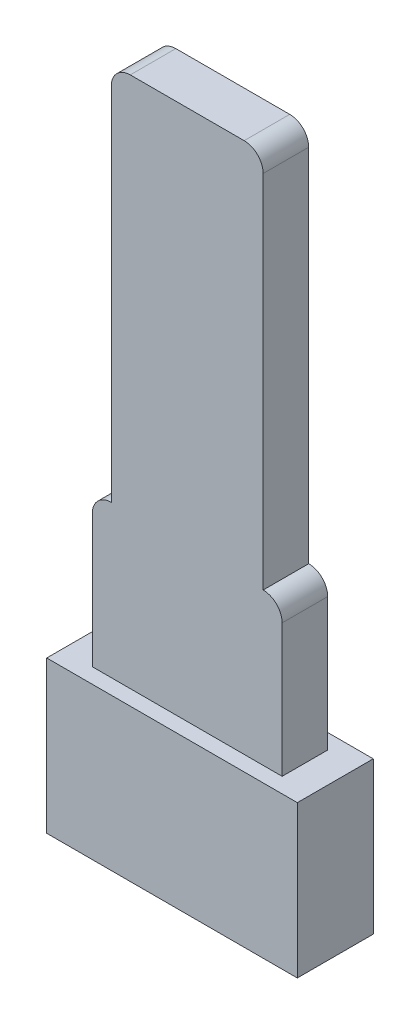
ISO-10303-21;
HEADER;
FILE_DESCRIPTION(('STEP AP214'),'2;1');
FILE_NAME('part.step','',(''),(''),'','','');
FILE_SCHEMA(('AUTOMOTIVE_DESIGN { 1 0 10303 214 1 1 1 1 }'));
ENDSEC;
DATA;
#1=APPLICATION_CONTEXT('core data for automotive mechanical design processes');
#2=APPLICATION_PROTOCOL_DEFINITION('international standard','automotive_design',2000,#1);
#3=PRODUCT_CONTEXT('',#1,'mechanical');
#4=PRODUCT('Part','Part','',(#3));
#5=PRODUCT_RELATED_PRODUCT_CATEGORY('part','',(#4));
#6=PRODUCT_DEFINITION_FORMATION('','',#4);
#7=PRODUCT_DEFINITION_CONTEXT('part definition',#1,'design');
#8=PRODUCT_DEFINITION('design','',#6,#7);
#9=PRODUCT_DEFINITION_SHAPE('','',#8);
#10=(LENGTH_UNIT() NAMED_UNIT(*) SI_UNIT(.MILLI.,.METRE.));
#11=(NAMED_UNIT(*) PLANE_ANGLE_UNIT() SI_UNIT($,.RADIAN.));
#12=(NAMED_UNIT(*) SI_UNIT($,.STERADIAN.) SOLID_ANGLE_UNIT());
#13=UNCERTAINTY_MEASURE_WITH_UNIT(LENGTH_MEASURE(1.E-05),#10,'distance_accuracy_value','');
#14=(GEOMETRIC_REPRESENTATION_CONTEXT(3) GLOBAL_UNCERTAINTY_ASSIGNED_CONTEXT((#13)) GLOBAL_UNIT_ASSIGNED_CONTEXT((#10,
#11,#12)) REPRESENTATION_CONTEXT('',''));
#15=CARTESIAN_POINT('',(0.,0.,0.));
#16=DIRECTION('',(0.,0.,1.));
#17=DIRECTION('',(1.,0.,0.));
#18=AXIS2_PLACEMENT_3D('',#15,#16,#17);
#19=CARTESIAN_POINT('',(0.,4.,0.));
#20=DIRECTION('',(0.,-1.,0.));
#21=DIRECTION('',(0.,0.,-1.));
#22=AXIS2_PLACEMENT_3D('',#19,#20,#21);
#23=PLANE('',#22);
#24=DIRECTION('',(0.,0.,-1.));
#25=VECTOR('',#24,1.);
#26=CARTESIAN_POINT('',(3.3,4.,1.));
#27=LINE('',#26,#25);
#28=CARTESIAN_POINT('',(3.3,4.,1.));
#29=VERTEX_POINT('',#28);
#30=CARTESIAN_POINT('',(3.3,4.,-1.));
#31=VERTEX_POINT('',#30);
#32=EDGE_CURVE('E193',#29,#31,#27,.T.);
#33=ORIENTED_EDGE('',*,*,#32,.T.);
#34=DIRECTION('',(-1.,0.,0.));
#35=VECTOR('',#34,1.);
#36=CARTESIAN_POINT('',(-3.3,4.,-1.));
#37=LINE('',#36,#35);
#38=CARTESIAN_POINT('',(-3.3,4.,-1.));
#39=VERTEX_POINT('',#38);
#40=EDGE_CURVE('E196',#31,#39,#37,.T.);
#41=ORIENTED_EDGE('',*,*,#40,.T.);
#42=DIRECTION('',(0.,0.,1.));
#43=VECTOR('',#42,1.);
#44=CARTESIAN_POINT('',(-3.3,4.,1.));
#45=LINE('',#44,#43);
#46=CARTESIAN_POINT('',(-3.3,4.,1.));
#47=VERTEX_POINT('',#46);
#48=EDGE_CURVE('E199',#39,#47,#45,.T.);
#49=ORIENTED_EDGE('',*,*,#48,.T.);
#50=DIRECTION('',(1.,0.,0.));
#51=VECTOR('',#50,1.);
#52=CARTESIAN_POINT('',(-3.3,4.,1.));
#53=LINE('',#52,#51);
#54=EDGE_CURVE('E201',#47,#29,#53,.T.);
#55=ORIENTED_EDGE('',*,*,#54,.T.);
#56=EDGE_LOOP('',(#33,#41,#49,#55));
#57=FACE_BOUND('',#56,.T.);
#58=DIRECTION('',(0.,0.,-1.));
#59=VECTOR('',#58,1.);
#60=CARTESIAN_POINT('',(2.5,4.,0.6));
#61=LINE('',#60,#59);
#62=CARTESIAN_POINT('',(2.5,4.,0.6));
#63=VERTEX_POINT('',#62);
#64=CARTESIAN_POINT('',(2.5,4.,-0.6));
#65=VERTEX_POINT('',#64);
#66=EDGE_CURVE('E171',#63,#65,#61,.T.);
#67=ORIENTED_EDGE('',*,*,#66,.F.);
#68=DIRECTION('',(1.,0.,0.));
#69=VECTOR('',#68,1.);
#70=CARTESIAN_POINT('',(-2.5,4.,0.6));
#71=LINE('',#70,#69);
#72=CARTESIAN_POINT('',(-2.5,4.,0.6));
#73=VERTEX_POINT('',#72);
#74=EDGE_CURVE('E181',#73,#63,#71,.T.);
#75=ORIENTED_EDGE('',*,*,#74,.F.);
#76=DIRECTION('',(0.,0.,1.));
#77=VECTOR('',#76,1.);
#78=CARTESIAN_POINT('',(-2.5,4.,0.6));
#79=LINE('',#78,#77);
#80=CARTESIAN_POINT('',(-2.5,4.,-0.6));
#81=VERTEX_POINT('',#80);
#82=EDGE_CURVE('E178',#81,#73,#79,.T.);
#83=ORIENTED_EDGE('',*,*,#82,.F.);
#84=DIRECTION('',(-1.,0.,0.));
#85=VECTOR('',#84,1.);
#86=CARTESIAN_POINT('',(-2.5,4.,-0.6));
#87=LINE('',#86,#85);
#88=EDGE_CURVE('E174',#65,#81,#87,.T.);
#89=ORIENTED_EDGE('',*,*,#88,.F.);
#90=EDGE_LOOP('',(#67,#75,#83,#89));
#91=FACE_BOUND('',#90,.T.);
#92=ADVANCED_FACE('F33',(#57,#91),#23,.F.);
#93=CARTESIAN_POINT('',(3.3,4.,1.));
#94=DIRECTION('',(-1.,0.,0.));
#95=DIRECTION('',(0.,0.,1.));
#96=AXIS2_PLACEMENT_3D('',#93,#94,#95);
#97=PLANE('',#96);
#98=DIRECTION('',(0.,0.,-1.));
#99=VECTOR('',#98,1.);
#100=CARTESIAN_POINT('',(3.3,0.,1.));
#101=LINE('',#100,#99);
#102=CARTESIAN_POINT('',(3.3,0.,1.));
#103=VERTEX_POINT('',#102);
#104=CARTESIAN_POINT('',(3.3,0.,-1.));
#105=VERTEX_POINT('',#104);
#106=EDGE_CURVE('E192',#103,#105,#101,.T.);
#107=ORIENTED_EDGE('',*,*,#106,.T.);
#108=DIRECTION('',(0.,-1.,0.));
#109=VECTOR('',#108,1.);
#110=CARTESIAN_POINT('',(3.3,4.,-1.));
#111=LINE('',#110,#109);
#112=EDGE_CURVE('E162',#31,#105,#111,.T.);
#113=ORIENTED_EDGE('',*,*,#112,.F.);
#114=ORIENTED_EDGE('',*,*,#32,.F.);
#115=DIRECTION('',(0.,-1.,0.));
#116=VECTOR('',#115,1.);
#117=CARTESIAN_POINT('',(3.3,4.,1.));
#118=LINE('',#117,#116);
#119=EDGE_CURVE('E203',#29,#103,#118,.T.);
#120=ORIENTED_EDGE('',*,*,#119,.T.);
#121=EDGE_LOOP('',(#107,#113,#114,#120));
#122=FACE_BOUND('',#121,.T.);
#123=ADVANCED_FACE('F305',(#122),#97,.F.);
#124=CARTESIAN_POINT('',(-3.3,4.,-1.));
#125=DIRECTION('',(0.,0.,1.));
#126=DIRECTION('',(1.,0.,0.));
#127=AXIS2_PLACEMENT_3D('',#124,#125,#126);
#128=PLANE('',#127);
#129=DIRECTION('',(-1.,0.,0.));
#130=VECTOR('',#129,1.);
#131=CARTESIAN_POINT('',(-3.3,0.,-1.));
#132=LINE('',#131,#130);
#133=CARTESIAN_POINT('',(-3.3,0.,-1.));
#134=VERTEX_POINT('',#133);
#135=EDGE_CURVE('E206',#105,#134,#132,.T.);
#136=ORIENTED_EDGE('',*,*,#135,.T.);
#137=DIRECTION('',(0.,-1.,0.));
#138=VECTOR('',#137,1.);
#139=CARTESIAN_POINT('',(-3.3,4.,-1.));
#140=LINE('',#139,#138);
#141=EDGE_CURVE('E215',#39,#134,#140,.T.);
#142=ORIENTED_EDGE('',*,*,#141,.F.);
#143=ORIENTED_EDGE('',*,*,#40,.F.);
#144=ORIENTED_EDGE('',*,*,#112,.T.);
#145=EDGE_LOOP('',(#136,#142,#143,#144));
#146=FACE_BOUND('',#145,.T.);
#147=ADVANCED_FACE('F311',(#146),#128,.F.);
#148=CARTESIAN_POINT('',(-3.3,4.,1.));
#149=DIRECTION('',(1.,0.,0.));
#150=DIRECTION('',(0.,0.,-1.));
#151=AXIS2_PLACEMENT_3D('',#148,#149,#150);
#152=PLANE('',#151);
#153=DIRECTION('',(0.,0.,1.));
#154=VECTOR('',#153,1.);
#155=CARTESIAN_POINT('',(-3.3,0.,1.));
#156=LINE('',#155,#154);
#157=CARTESIAN_POINT('',(-3.3,0.,1.));
#158=VERTEX_POINT('',#157);
#159=EDGE_CURVE('E208',#134,#158,#156,.T.);
#160=ORIENTED_EDGE('',*,*,#159,.T.);
#161=DIRECTION('',(0.,-1.,0.));
#162=VECTOR('',#161,1.);
#163=CARTESIAN_POINT('',(-3.3,4.,1.));
#164=LINE('',#163,#162);
#165=EDGE_CURVE('E213',#47,#158,#164,.T.);
#166=ORIENTED_EDGE('',*,*,#165,.F.);
#167=ORIENTED_EDGE('',*,*,#48,.F.);
#168=ORIENTED_EDGE('',*,*,#141,.T.);
#169=EDGE_LOOP('',(#160,#166,#167,#168));
#170=FACE_BOUND('',#169,.T.);
#171=ADVANCED_FACE('F324',(#170),#152,.F.);
#172=CARTESIAN_POINT('',(-3.3,4.,1.));
#173=DIRECTION('',(0.,0.,-1.));
#174=DIRECTION('',(-1.,0.,0.));
#175=AXIS2_PLACEMENT_3D('',#172,#173,#174);
#176=PLANE('',#175);
#177=DIRECTION('',(1.,0.,0.));
#178=VECTOR('',#177,1.);
#179=CARTESIAN_POINT('',(-3.3,0.,1.));
#180=LINE('',#179,#178);
#181=EDGE_CURVE('E197',#158,#103,#180,.T.);
#182=ORIENTED_EDGE('',*,*,#181,.T.);
#183=ORIENTED_EDGE('',*,*,#119,.F.);
#184=ORIENTED_EDGE('',*,*,#54,.F.);
#185=ORIENTED_EDGE('',*,*,#165,.T.);
#186=EDGE_LOOP('',(#182,#183,#184,#185));
#187=FACE_BOUND('',#186,.T.);
#188=ADVANCED_FACE('F320',(#187),#176,.F.);
#189=CARTESIAN_POINT('',(0.,0.,0.));
#190=DIRECTION('',(0.,-1.,0.));
#191=DIRECTION('',(0.,0.,-1.));
#192=AXIS2_PLACEMENT_3D('',#189,#190,#191);
#193=PLANE('',#192);
#194=ORIENTED_EDGE('',*,*,#106,.F.);
#195=ORIENTED_EDGE('',*,*,#181,.F.);
#196=ORIENTED_EDGE('',*,*,#159,.F.);
#197=ORIENTED_EDGE('',*,*,#135,.F.);
#198=EDGE_LOOP('',(#194,#195,#196,#197));
#199=FACE_BOUND('',#198,.T.);
#200=ADVANCED_FACE('F317',(#199),#193,.T.);
#201=CARTESIAN_POINT('',(2.5,8.,0.6));
#202=DIRECTION('',(-1.,0.,0.));
#203=DIRECTION('',(0.,0.,1.));
#204=AXIS2_PLACEMENT_3D('',#201,#202,#203);
#205=PLANE('',#204);
#206=DIRECTION('',(0.,-1.,0.));
#207=VECTOR('',#206,1.);
#208=CARTESIAN_POINT('',(2.5,8.,-0.6));
#209=LINE('',#208,#207);
#210=CARTESIAN_POINT('',(2.5,7.5,-0.6));
#211=VERTEX_POINT('',#210);
#212=EDGE_CURVE('E190',#211,#65,#209,.T.);
#213=ORIENTED_EDGE('',*,*,#212,.F.);
#214=DIRECTION('',(0.,0.,-1.));
#215=VECTOR('',#214,1.);
#216=CARTESIAN_POINT('',(2.5,7.5,0.6));
#217=LINE('',#216,#215);
#218=CARTESIAN_POINT('',(2.5,7.5,0.6));
#219=VERTEX_POINT('',#218);
#220=EDGE_CURVE('E241',#211,#219,#217,.F.);
#221=ORIENTED_EDGE('',*,*,#220,.T.);
#222=DIRECTION('',(0.,-1.,0.));
#223=VECTOR('',#222,1.);
#224=CARTESIAN_POINT('',(2.5,8.,0.6));
#225=LINE('',#224,#223);
#226=EDGE_CURVE('E184',#219,#63,#225,.T.);
#227=ORIENTED_EDGE('',*,*,#226,.T.);
#228=ORIENTED_EDGE('',*,*,#66,.T.);
#229=EDGE_LOOP('',(#213,#221,#227,#228));
#230=FACE_BOUND('',#229,.T.);
#231=ADVANCED_FACE('F265',(#230),#205,.F.);
#232=CARTESIAN_POINT('',(-2.5,8.,-0.6));
#233=DIRECTION('',(0.,0.,1.));
#234=DIRECTION('',(1.,0.,0.));
#235=AXIS2_PLACEMENT_3D('',#232,#233,#234);
#236=PLANE('',#235);
#237=DIRECTION('',(0.,-1.,0.));
#238=VECTOR('',#237,1.);
#239=CARTESIAN_POINT('',(2.,18.,-0.6));
#240=LINE('',#239,#238);
#241=CARTESIAN_POINT('',(2.,17.5,-0.6));
#242=VERTEX_POINT('',#241);
#243=CARTESIAN_POINT('',(2.,8.,-0.6));
#244=VERTEX_POINT('',#243);
#245=EDGE_CURVE('E175',#242,#244,#240,.T.);
#246=ORIENTED_EDGE('',*,*,#245,.T.);
#247=CARTESIAN_POINT('',(2.,7.5,-0.6));
#248=DIRECTION('',(0.,0.,1.));
#249=DIRECTION('',(1.,0.,0.));
#250=AXIS2_PLACEMENT_3D('',#247,#248,#249);
#251=CIRCLE('',#250,0.5);
#252=EDGE_CURVE('E237',#244,#211,#251,.F.);
#253=ORIENTED_EDGE('',*,*,#252,.T.);
#254=ORIENTED_EDGE('',*,*,#212,.T.);
#255=ORIENTED_EDGE('',*,*,#88,.T.);
#256=DIRECTION('',(0.,-1.,0.));
#257=VECTOR('',#256,1.);
#258=CARTESIAN_POINT('',(-2.5,8.,-0.6));
#259=LINE('',#258,#257);
#260=CARTESIAN_POINT('',(-2.5,7.5,-0.6));
#261=VERTEX_POINT('',#260);
#262=EDGE_CURVE('E188',#261,#81,#259,.T.);
#263=ORIENTED_EDGE('',*,*,#262,.F.);
#264=CARTESIAN_POINT('',(-2.,7.5,-0.6));
#265=DIRECTION('',(0.,0.,1.));
#266=DIRECTION('',(1.,0.,0.));
#267=AXIS2_PLACEMENT_3D('',#264,#265,#266);
#268=CIRCLE('',#267,0.5);
#269=CARTESIAN_POINT('',(-2.,8.,-0.6));
#270=VERTEX_POINT('',#269);
#271=EDGE_CURVE('E230',#261,#270,#268,.F.);
#272=ORIENTED_EDGE('',*,*,#271,.T.);
#273=DIRECTION('',(0.,-1.,0.));
#274=VECTOR('',#273,1.);
#275=CARTESIAN_POINT('',(-2.,18.,-0.6));
#276=LINE('',#275,#274);
#277=CARTESIAN_POINT('',(-2.,17.5,-0.6));
#278=VERTEX_POINT('',#277);
#279=EDGE_CURVE('E145',#278,#270,#276,.T.);
#280=ORIENTED_EDGE('',*,*,#279,.F.);
#281=CARTESIAN_POINT('',(-1.5,17.5,-0.6));
#282=DIRECTION('',(0.,0.,1.));
#283=DIRECTION('',(1.,0.,0.));
#284=AXIS2_PLACEMENT_3D('',#281,#282,#283);
#285=CIRCLE('',#284,0.5);
#286=CARTESIAN_POINT('',(-1.5,18.,-0.6));
#287=VERTEX_POINT('',#286);
#288=EDGE_CURVE('E222',#278,#287,#285,.F.);
#289=ORIENTED_EDGE('',*,*,#288,.T.);
#290=DIRECTION('',(-1.,0.,0.));
#291=VECTOR('',#290,1.);
#292=CARTESIAN_POINT('',(-2.,18.,-0.6));
#293=LINE('',#292,#291);
#294=CARTESIAN_POINT('',(1.5,18.,-0.6));
#295=VERTEX_POINT('',#294);
#296=EDGE_CURVE('E151',#295,#287,#293,.T.);
#297=ORIENTED_EDGE('',*,*,#296,.F.);
#298=CARTESIAN_POINT('',(1.5,17.5,-0.6));
#299=DIRECTION('',(0.,0.,1.));
#300=DIRECTION('',(1.,0.,0.));
#301=AXIS2_PLACEMENT_3D('',#298,#299,#300);
#302=CIRCLE('',#301,0.5);
#303=EDGE_CURVE('E225',#295,#242,#302,.F.);
#304=ORIENTED_EDGE('',*,*,#303,.T.);
#305=EDGE_LOOP('',(#246,#253,#254,#255,#263,#272,#280,#289,#297,#304));
#306=FACE_BOUND('',#305,.T.);
#307=ADVANCED_FACE('F253',(#306),#236,.F.);
#308=CARTESIAN_POINT('',(-2.5,8.,0.6));
#309=DIRECTION('',(1.,0.,0.));
#310=DIRECTION('',(0.,0.,-1.));
#311=AXIS2_PLACEMENT_3D('',#308,#309,#310);
#312=PLANE('',#311);
#313=DIRECTION('',(0.,-1.,0.));
#314=VECTOR('',#313,1.);
#315=CARTESIAN_POINT('',(-2.5,8.,0.6));
#316=LINE('',#315,#314);
#317=CARTESIAN_POINT('',(-2.5,7.5,0.6));
#318=VERTEX_POINT('',#317);
#319=EDGE_CURVE('E186',#318,#73,#316,.T.);
#320=ORIENTED_EDGE('',*,*,#319,.F.);
#321=DIRECTION('',(0.,0.,1.));
#322=VECTOR('',#321,1.);
#323=CARTESIAN_POINT('',(-2.5,7.5,0.6));
#324=LINE('',#323,#322);
#325=EDGE_CURVE('E136',#318,#261,#324,.F.);
#326=ORIENTED_EDGE('',*,*,#325,.T.);
#327=ORIENTED_EDGE('',*,*,#262,.T.);
#328=ORIENTED_EDGE('',*,*,#82,.T.);
#329=EDGE_LOOP('',(#320,#326,#327,#328));
#330=FACE_BOUND('',#329,.T.);
#331=ADVANCED_FACE('F272',(#330),#312,.F.);
#332=CARTESIAN_POINT('',(-2.5,8.,0.6));
#333=DIRECTION('',(0.,0.,-1.));
#334=DIRECTION('',(-1.,0.,0.));
#335=AXIS2_PLACEMENT_3D('',#332,#333,#334);
#336=PLANE('',#335);
#337=ORIENTED_EDGE('',*,*,#226,.F.);
#338=CARTESIAN_POINT('',(2.,7.5,0.6));
#339=DIRECTION('',(0.,0.,-1.));
#340=DIRECTION('',(-1.,0.,0.));
#341=AXIS2_PLACEMENT_3D('',#338,#339,#340);
#342=CIRCLE('',#341,0.5);
#343=CARTESIAN_POINT('',(2.,8.,0.6));
#344=VERTEX_POINT('',#343);
#345=EDGE_CURVE('E137',#219,#344,#342,.F.);
#346=ORIENTED_EDGE('',*,*,#345,.T.);
#347=DIRECTION('',(0.,-1.,0.));
#348=VECTOR('',#347,1.);
#349=CARTESIAN_POINT('',(2.,18.,0.6));
#350=LINE('',#349,#348);
#351=CARTESIAN_POINT('',(2.,17.5,0.6));
#352=VERTEX_POINT('',#351);
#353=EDGE_CURVE('E146',#352,#344,#350,.T.);
#354=ORIENTED_EDGE('',*,*,#353,.F.);
#355=CARTESIAN_POINT('',(1.5,17.5,0.6));
#356=DIRECTION('',(0.,0.,-1.));
#357=DIRECTION('',(-1.,0.,0.));
#358=AXIS2_PLACEMENT_3D('',#355,#356,#357);
#359=CIRCLE('',#358,0.5);
#360=CARTESIAN_POINT('',(1.5,18.,0.6));
#361=VERTEX_POINT('',#360);
#362=EDGE_CURVE('E138',#352,#361,#359,.F.);
#363=ORIENTED_EDGE('',*,*,#362,.T.);
#364=DIRECTION('',(1.,0.,0.));
#365=VECTOR('',#364,1.);
#366=CARTESIAN_POINT('',(-2.,18.,0.6));
#367=LINE('',#366,#365);
#368=CARTESIAN_POINT('',(-1.5,18.,0.6));
#369=VERTEX_POINT('',#368);
#370=EDGE_CURVE('E155',#369,#361,#367,.T.);
#371=ORIENTED_EDGE('',*,*,#370,.F.);
#372=CARTESIAN_POINT('',(-1.5,17.5,0.6));
#373=DIRECTION('',(0.,0.,-1.));
#374=DIRECTION('',(-1.,0.,0.));
#375=AXIS2_PLACEMENT_3D('',#372,#373,#374);
#376=CIRCLE('',#375,0.5);
#377=CARTESIAN_POINT('',(-2.,17.5,0.6));
#378=VERTEX_POINT('',#377);
#379=EDGE_CURVE('E54',#369,#378,#376,.F.);
#380=ORIENTED_EDGE('',*,*,#379,.T.);
#381=DIRECTION('',(0.,-1.,0.));
#382=VECTOR('',#381,1.);
#383=CARTESIAN_POINT('',(-2.,18.,0.6));
#384=LINE('',#383,#382);
#385=CARTESIAN_POINT('',(-2.,8.,0.6));
#386=VERTEX_POINT('',#385);
#387=EDGE_CURVE('E140',#378,#386,#384,.T.);
#388=ORIENTED_EDGE('',*,*,#387,.T.);
#389=CARTESIAN_POINT('',(-2.,7.5,0.6));
#390=DIRECTION('',(0.,0.,-1.));
#391=DIRECTION('',(-1.,0.,0.));
#392=AXIS2_PLACEMENT_3D('',#389,#390,#391);
#393=CIRCLE('',#392,0.5);
#394=EDGE_CURVE('E48',#386,#318,#393,.F.);
#395=ORIENTED_EDGE('',*,*,#394,.T.);
#396=ORIENTED_EDGE('',*,*,#319,.T.);
#397=ORIENTED_EDGE('',*,*,#74,.T.);
#398=EDGE_LOOP('',(#337,#346,#354,#363,#371,#380,#388,#395,#396,#397));
#399=FACE_BOUND('',#398,.T.);
#400=ADVANCED_FACE('F142',(#399),#336,.F.);
#401=CARTESIAN_POINT('',(2.,18.,0.6));
#402=DIRECTION('',(-1.,0.,0.));
#403=DIRECTION('',(0.,0.,1.));
#404=AXIS2_PLACEMENT_3D('',#401,#402,#403);
#405=PLANE('',#404);
#406=ORIENTED_EDGE('',*,*,#245,.F.);
#407=DIRECTION('',(0.,0.,-1.));
#408=VECTOR('',#407,1.);
#409=CARTESIAN_POINT('',(2.,17.5,0.6));
#410=LINE('',#409,#408);
#411=EDGE_CURVE('E41',#242,#352,#410,.F.);
#412=ORIENTED_EDGE('',*,*,#411,.T.);
#413=ORIENTED_EDGE('',*,*,#353,.T.);
#414=DIRECTION('',(0.,0.,-1.));
#415=VECTOR('',#414,1.);
#416=CARTESIAN_POINT('',(2.,8.,0.6));
#417=LINE('',#416,#415);
#418=EDGE_CURVE('E152',#344,#244,#417,.T.);
#419=ORIENTED_EDGE('',*,*,#418,.T.);
#420=EDGE_LOOP('',(#406,#412,#413,#419));
#421=FACE_BOUND('',#420,.T.);
#422=ADVANCED_FACE('F258',(#421),#405,.F.);
#423=CARTESIAN_POINT('',(-2.,18.,0.6));
#424=DIRECTION('',(1.,0.,0.));
#425=DIRECTION('',(0.,0.,-1.));
#426=AXIS2_PLACEMENT_3D('',#423,#424,#425);
#427=PLANE('',#426);
#428=ORIENTED_EDGE('',*,*,#387,.F.);
#429=DIRECTION('',(0.,0.,1.));
#430=VECTOR('',#429,1.);
#431=CARTESIAN_POINT('',(-2.,17.5,0.6));
#432=LINE('',#431,#430);
#433=EDGE_CURVE('E11',#378,#278,#432,.F.);
#434=ORIENTED_EDGE('',*,*,#433,.T.);
#435=ORIENTED_EDGE('',*,*,#279,.T.);
#436=DIRECTION('',(0.,0.,1.));
#437=VECTOR('',#436,1.);
#438=CARTESIAN_POINT('',(-2.,8.,0.6));
#439=LINE('',#438,#437);
#440=EDGE_CURVE('E135',#270,#386,#439,.T.);
#441=ORIENTED_EDGE('',*,*,#440,.T.);
#442=EDGE_LOOP('',(#428,#434,#435,#441));
#443=FACE_BOUND('',#442,.T.);
#444=ADVANCED_FACE('F149',(#443),#427,.F.);
#445=CARTESIAN_POINT('',(0.,18.,0.));
#446=DIRECTION('',(0.,-1.,0.));
#447=DIRECTION('',(0.,0.,-1.));
#448=AXIS2_PLACEMENT_3D('',#445,#446,#447);
#449=PLANE('',#448);
#450=ORIENTED_EDGE('',*,*,#370,.T.);
#451=DIRECTION('',(0.,0.,-1.));
#452=VECTOR('',#451,1.);
#453=CARTESIAN_POINT('',(1.5,18.,0.));
#454=LINE('',#453,#452);
#455=EDGE_CURVE('E280',#361,#295,#454,.T.);
#456=ORIENTED_EDGE('',*,*,#455,.T.);
#457=ORIENTED_EDGE('',*,*,#296,.T.);
#458=DIRECTION('',(0.,0.,1.));
#459=VECTOR('',#458,1.);
#460=CARTESIAN_POINT('',(-1.5,18.,0.));
#461=LINE('',#460,#459);
#462=EDGE_CURVE('E277',#287,#369,#461,.T.);
#463=ORIENTED_EDGE('',*,*,#462,.T.);
#464=EDGE_LOOP('',(#450,#456,#457,#463));
#465=FACE_BOUND('',#464,.T.);
#466=ADVANCED_FACE('F295',(#465),#449,.F.);
#467=CARTESIAN_POINT('',(2.,7.5,0.));
#468=DIRECTION('',(0.,0.,-1.));
#469=DIRECTION('',(-1.,0.,0.));
#470=AXIS2_PLACEMENT_3D('',#467,#468,#469);
#471=CYLINDRICAL_SURFACE('',#470,0.5);
#472=ORIENTED_EDGE('',*,*,#345,.F.);
#473=ORIENTED_EDGE('',*,*,#220,.F.);
#474=ORIENTED_EDGE('',*,*,#252,.F.);
#475=ORIENTED_EDGE('',*,*,#418,.F.);
#476=EDGE_LOOP('',(#472,#473,#474,#475));
#477=FACE_BOUND('',#476,.T.);
#478=ADVANCED_FACE('F262',(#477),#471,.T.);
#479=CARTESIAN_POINT('',(-2.,7.5,0.));
#480=DIRECTION('',(0.,0.,1.));
#481=DIRECTION('',(1.,0.,0.));
#482=AXIS2_PLACEMENT_3D('',#479,#480,#481);
#483=CYLINDRICAL_SURFACE('',#482,0.5);
#484=ORIENTED_EDGE('',*,*,#271,.F.);
#485=ORIENTED_EDGE('',*,*,#325,.F.);
#486=ORIENTED_EDGE('',*,*,#394,.F.);
#487=ORIENTED_EDGE('',*,*,#440,.F.);
#488=EDGE_LOOP('',(#484,#485,#486,#487));
#489=FACE_BOUND('',#488,.T.);
#490=ADVANCED_FACE('F133',(#489),#483,.T.);
#491=CARTESIAN_POINT('',(1.5,17.5,0.));
#492=DIRECTION('',(0.,0.,-1.));
#493=DIRECTION('',(-1.,0.,0.));
#494=AXIS2_PLACEMENT_3D('',#491,#492,#493);
#495=CYLINDRICAL_SURFACE('',#494,0.5);
#496=ORIENTED_EDGE('',*,*,#362,.F.);
#497=ORIENTED_EDGE('',*,*,#411,.F.);
#498=ORIENTED_EDGE('',*,*,#303,.F.);
#499=ORIENTED_EDGE('',*,*,#455,.F.);
#500=EDGE_LOOP('',(#496,#497,#498,#499));
#501=FACE_BOUND('',#500,.T.);
#502=ADVANCED_FACE('F289',(#501),#495,.T.);
#503=CARTESIAN_POINT('',(-1.5,17.5,0.));
#504=DIRECTION('',(0.,0.,1.));
#505=DIRECTION('',(1.,0.,0.));
#506=AXIS2_PLACEMENT_3D('',#503,#504,#505);
#507=CYLINDRICAL_SURFACE('',#506,0.5);
#508=ORIENTED_EDGE('',*,*,#288,.F.);
#509=ORIENTED_EDGE('',*,*,#433,.F.);
#510=ORIENTED_EDGE('',*,*,#379,.F.);
#511=ORIENTED_EDGE('',*,*,#462,.F.);
#512=EDGE_LOOP('',(#508,#509,#510,#511));
#513=FACE_BOUND('',#512,.T.);
#514=ADVANCED_FACE('F35',(#513),#507,.T.);
#515=CLOSED_SHELL('',(#92,#123,#147,#171,#188,#200,#231,#307,#331,#400,#422,#444,#466,#478,#490,
#502,#514));
#516=MANIFOLD_SOLID_BREP('B2',#515);
#517=ADVANCED_BREP_SHAPE_REPRESENTATION('',(#18,#516),#14);
#518=SHAPE_DEFINITION_REPRESENTATION(#9,#517);
ENDSEC;
END-ISO-10303-21;
